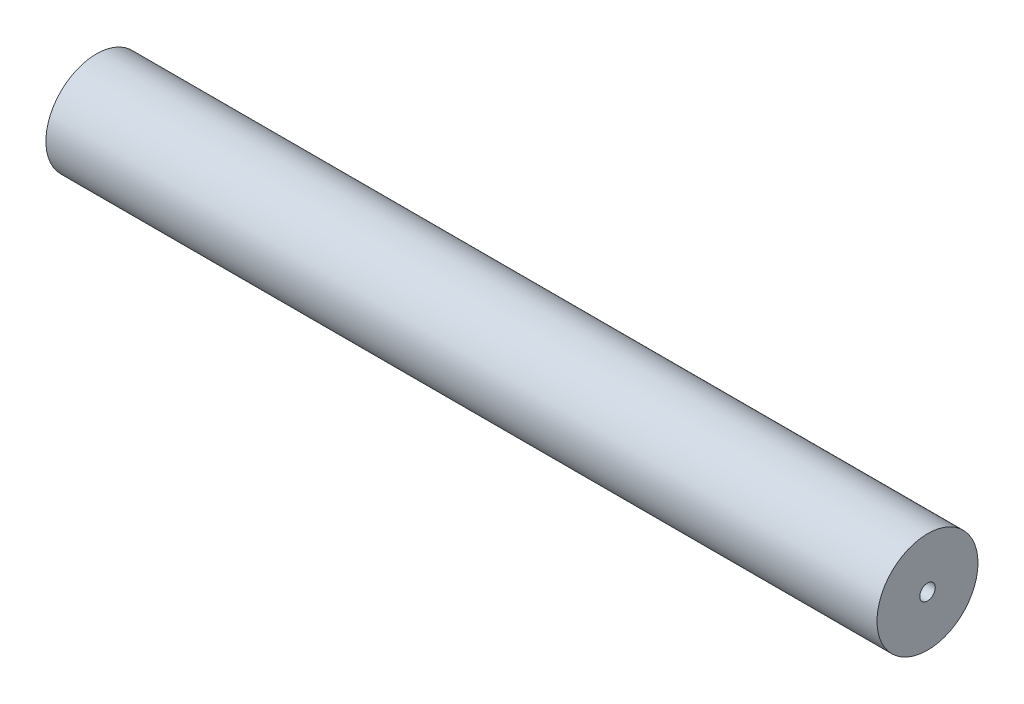
ISO-10303-21;
HEADER;
FILE_DESCRIPTION(('STEP AP214'),'2;1');
FILE_NAME('part.step','',(''),(''),'','','');
FILE_SCHEMA(('AUTOMOTIVE_DESIGN { 1 0 10303 214 1 1 1 1 }'));
ENDSEC;
DATA;
#1=APPLICATION_CONTEXT('core data for automotive mechanical design processes');
#2=APPLICATION_PROTOCOL_DEFINITION('international standard','automotive_design',2000,#1);
#3=PRODUCT_CONTEXT('',#1,'mechanical');
#4=PRODUCT('Part','Part','',(#3));
#5=PRODUCT_RELATED_PRODUCT_CATEGORY('part','',(#4));
#6=PRODUCT_DEFINITION_FORMATION('','',#4);
#7=PRODUCT_DEFINITION_CONTEXT('part definition',#1,'design');
#8=PRODUCT_DEFINITION('design','',#6,#7);
#9=PRODUCT_DEFINITION_SHAPE('','',#8);
#10=(LENGTH_UNIT() NAMED_UNIT(*) SI_UNIT(.MILLI.,.METRE.));
#11=(NAMED_UNIT(*) PLANE_ANGLE_UNIT() SI_UNIT($,.RADIAN.));
#12=(NAMED_UNIT(*) SI_UNIT($,.STERADIAN.) SOLID_ANGLE_UNIT());
#13=UNCERTAINTY_MEASURE_WITH_UNIT(LENGTH_MEASURE(1.E-05),#10,'distance_accuracy_value','');
#14=(GEOMETRIC_REPRESENTATION_CONTEXT(3) GLOBAL_UNCERTAINTY_ASSIGNED_CONTEXT((#13)) GLOBAL_UNIT_ASSIGNED_CONTEXT((#10,
#11,#12)) REPRESENTATION_CONTEXT('',''));
#15=CARTESIAN_POINT('',(0.,0.,0.));
#16=DIRECTION('',(0.,0.,1.));
#17=DIRECTION('',(1.,0.,0.));
#18=AXIS2_PLACEMENT_3D('',#15,#16,#17);
#19=CARTESIAN_POINT('',(-42.5,3.24999999999999,0.));
#20=DIRECTION('',(-1.,0.,0.));
#21=DIRECTION('',(0.,0.,1.));
#22=AXIS2_PLACEMENT_3D('',#19,#20,#21);
#23=PLANE('',#22);
#24=CARTESIAN_POINT('',(-42.5,0.,0.));
#25=DIRECTION('',(1.,0.,0.));
#26=DIRECTION('',(0.,0.,-1.));
#27=AXIS2_PLACEMENT_3D('',#24,#25,#26);
#28=CIRCLE('',#27,2.24999999999999);
#29=CARTESIAN_POINT('',(-42.5,0.,-2.24999999999999));
#30=VERTEX_POINT('',#29);
#31=EDGE_CURVE('E64',#30,#30,#28,.T.);
#32=ORIENTED_EDGE('',*,*,#31,.T.);
#33=EDGE_LOOP('',(#32));
#34=FACE_BOUND('',#33,.T.);
#35=CARTESIAN_POINT('',(-42.5,0.,0.));
#36=DIRECTION('',(1.,0.,0.));
#37=DIRECTION('',(0.,0.,-1.));
#38=AXIS2_PLACEMENT_3D('',#35,#36,#37);
#39=CIRCLE('',#38,3.24999999999999);
#40=CARTESIAN_POINT('',(-42.5,0.,-3.24999999999999));
#41=VERTEX_POINT('',#40);
#42=EDGE_CURVE('E10',#41,#41,#39,.T.);
#43=ORIENTED_EDGE('',*,*,#42,.F.);
#44=EDGE_LOOP('',(#43));
#45=FACE_BOUND('',#44,.T.);
#46=ADVANCED_FACE('F37',(#34,#45),#23,.T.);
#47=CARTESIAN_POINT('',(13.5,0.,0.));
#48=DIRECTION('',(1.,0.,0.));
#49=DIRECTION('',(0.,0.,-1.));
#50=AXIS2_PLACEMENT_3D('',#47,#48,#49);
#51=CYLINDRICAL_SURFACE('',#50,3.25);
#52=ORIENTED_EDGE('',*,*,#42,.T.);
#53=EDGE_LOOP('',(#52));
#54=FACE_BOUND('',#53,.T.);
#55=CARTESIAN_POINT('',(11.,0.,0.));
#56=DIRECTION('',(1.,0.,0.));
#57=DIRECTION('',(0.,0.,-1.));
#58=AXIS2_PLACEMENT_3D('',#55,#56,#57);
#59=CIRCLE('',#58,3.25);
#60=CARTESIAN_POINT('',(11.,0.,-3.25));
#61=VERTEX_POINT('',#60);
#62=EDGE_CURVE('E44',#61,#61,#59,.T.);
#63=ORIENTED_EDGE('',*,*,#62,.F.);
#64=EDGE_LOOP('',(#63));
#65=FACE_BOUND('',#64,.T.);
#66=ADVANCED_FACE('F83',(#54,#65),#51,.T.);
#67=CARTESIAN_POINT('',(11.,0.499999999999998,0.));
#68=DIRECTION('',(1.,0.,0.));
#69=DIRECTION('',(0.,0.,-1.));
#70=AXIS2_PLACEMENT_3D('',#67,#68,#69);
#71=PLANE('',#70);
#72=ORIENTED_EDGE('',*,*,#62,.T.);
#73=EDGE_LOOP('',(#72));
#74=FACE_BOUND('',#73,.T.);
#75=CARTESIAN_POINT('',(11.,0.,0.));
#76=DIRECTION('',(1.,0.,0.));
#77=DIRECTION('',(0.,0.,-1.));
#78=AXIS2_PLACEMENT_3D('',#75,#76,#77);
#79=CIRCLE('',#78,0.499999999999998);
#80=CARTESIAN_POINT('',(11.,0.,-0.499999999999998));
#81=VERTEX_POINT('',#80);
#82=EDGE_CURVE('E49',#81,#81,#79,.T.);
#83=ORIENTED_EDGE('',*,*,#82,.F.);
#84=EDGE_LOOP('',(#83));
#85=FACE_BOUND('',#84,.T.);
#86=ADVANCED_FACE('F87',(#74,#85),#71,.T.);
#87=CARTESIAN_POINT('',(13.5,0.,0.));
#88=DIRECTION('',(1.,0.,0.));
#89=DIRECTION('',(0.,0.,-1.));
#90=AXIS2_PLACEMENT_3D('',#87,#88,#89);
#91=CYLINDRICAL_SURFACE('',#90,0.499999999999998);
#92=ORIENTED_EDGE('',*,*,#82,.T.);
#93=EDGE_LOOP('',(#92));
#94=FACE_BOUND('',#93,.T.);
#95=CARTESIAN_POINT('',(10.,0.,0.));
#96=DIRECTION('',(1.,0.,0.));
#97=DIRECTION('',(0.,0.,-1.));
#98=AXIS2_PLACEMENT_3D('',#95,#96,#97);
#99=CIRCLE('',#98,0.499999999999998);
#100=CARTESIAN_POINT('',(10.,0.,-0.499999999999998));
#101=VERTEX_POINT('',#100);
#102=EDGE_CURVE('E54',#101,#101,#99,.T.);
#103=ORIENTED_EDGE('',*,*,#102,.F.);
#104=EDGE_LOOP('',(#103));
#105=FACE_BOUND('',#104,.T.);
#106=ADVANCED_FACE('F79',(#94,#105),#91,.F.);
#107=CARTESIAN_POINT('',(10.,0.499999999999998,0.));
#108=DIRECTION('',(-1.,0.,0.));
#109=DIRECTION('',(0.,0.,1.));
#110=AXIS2_PLACEMENT_3D('',#107,#108,#109);
#111=PLANE('',#110);
#112=ORIENTED_EDGE('',*,*,#102,.T.);
#113=EDGE_LOOP('',(#112));
#114=FACE_BOUND('',#113,.T.);
#115=CARTESIAN_POINT('',(10.,0.,0.));
#116=DIRECTION('',(1.,0.,0.));
#117=DIRECTION('',(0.,0.,-1.));
#118=AXIS2_PLACEMENT_3D('',#115,#116,#117);
#119=CIRCLE('',#118,2.25);
#120=CARTESIAN_POINT('',(10.,0.,-2.25));
#121=VERTEX_POINT('',#120);
#122=EDGE_CURVE('E60',#121,#121,#119,.T.);
#123=ORIENTED_EDGE('',*,*,#122,.F.);
#124=EDGE_LOOP('',(#123));
#125=FACE_BOUND('',#124,.T.);
#126=ADVANCED_FACE('F73',(#114,#125),#111,.T.);
#127=CARTESIAN_POINT('',(13.5,0.,0.));
#128=DIRECTION('',(1.,0.,0.));
#129=DIRECTION('',(0.,0.,-1.));
#130=AXIS2_PLACEMENT_3D('',#127,#128,#129);
#131=CYLINDRICAL_SURFACE('',#130,2.25);
#132=ORIENTED_EDGE('',*,*,#122,.T.);
#133=EDGE_LOOP('',(#132));
#134=FACE_BOUND('',#133,.T.);
#135=ORIENTED_EDGE('',*,*,#31,.F.);
#136=EDGE_LOOP('',(#135));
#137=FACE_BOUND('',#136,.T.);
#138=ADVANCED_FACE('F71',(#134,#137),#131,.F.);
#139=CLOSED_SHELL('',(#46,#66,#86,#106,#126,#138));
#140=MANIFOLD_SOLID_BREP('B2',#139);
#141=ADVANCED_BREP_SHAPE_REPRESENTATION('',(#18,#140),#14);
#142=SHAPE_DEFINITION_REPRESENTATION(#9,#141);
ENDSEC;
END-ISO-10303-21;
